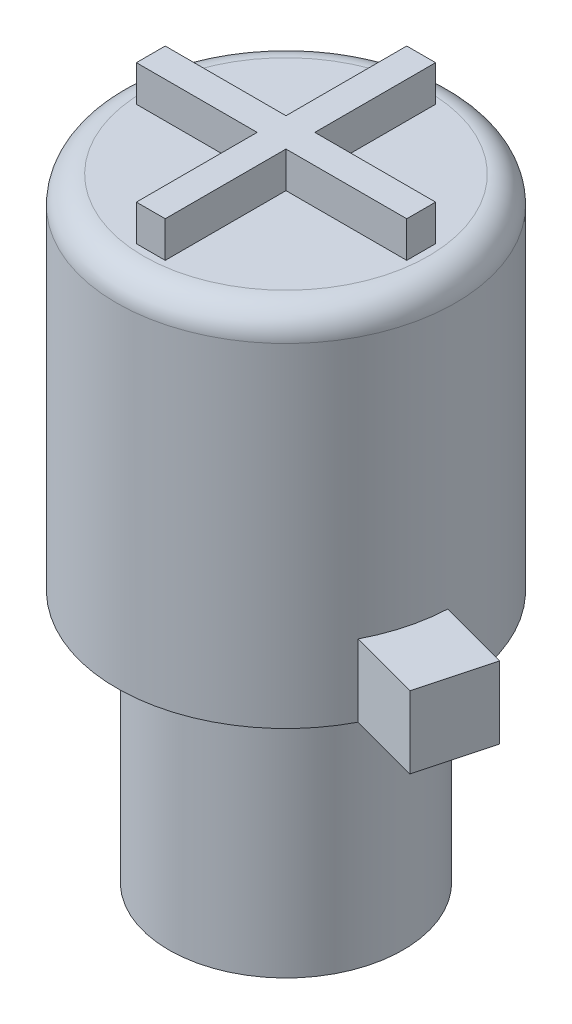
ISO-10303-21;
HEADER;
FILE_DESCRIPTION(('STEP AP214'),'2;1');
FILE_NAME('part.step','',(''),(''),'','','');
FILE_SCHEMA(('AUTOMOTIVE_DESIGN { 1 0 10303 214 1 1 1 1 }'));
ENDSEC;
DATA;
#1=APPLICATION_CONTEXT('core data for automotive mechanical design processes');
#2=APPLICATION_PROTOCOL_DEFINITION('international standard','automotive_design',2000,#1);
#3=PRODUCT_CONTEXT('',#1,'mechanical');
#4=PRODUCT('Part','Part','',(#3));
#5=PRODUCT_RELATED_PRODUCT_CATEGORY('part','',(#4));
#6=PRODUCT_DEFINITION_FORMATION('','',#4);
#7=PRODUCT_DEFINITION_CONTEXT('part definition',#1,'design');
#8=PRODUCT_DEFINITION('design','',#6,#7);
#9=PRODUCT_DEFINITION_SHAPE('','',#8);
#10=(LENGTH_UNIT() NAMED_UNIT(*) SI_UNIT(.MILLI.,.METRE.));
#11=(NAMED_UNIT(*) PLANE_ANGLE_UNIT() SI_UNIT($,.RADIAN.));
#12=(NAMED_UNIT(*) SI_UNIT($,.STERADIAN.) SOLID_ANGLE_UNIT());
#13=UNCERTAINTY_MEASURE_WITH_UNIT(LENGTH_MEASURE(1.E-05),#10,'distance_accuracy_value','');
#14=(GEOMETRIC_REPRESENTATION_CONTEXT(3) GLOBAL_UNCERTAINTY_ASSIGNED_CONTEXT((#13)) GLOBAL_UNIT_ASSIGNED_CONTEXT((#10,
#11,#12)) REPRESENTATION_CONTEXT('',''));
#15=CARTESIAN_POINT('',(0.,0.,0.));
#16=DIRECTION('',(0.,0.,1.));
#17=DIRECTION('',(1.,0.,0.));
#18=AXIS2_PLACEMENT_3D('',#15,#16,#17);
#19=CARTESIAN_POINT('',(0.,7.018,0.));
#20=DIRECTION('',(0.,-1.,0.));
#21=DIRECTION('',(0.,0.,-1.));
#22=AXIS2_PLACEMENT_3D('',#19,#20,#21);
#23=CYLINDRICAL_SURFACE('',#22,3.25);
#24=CARTESIAN_POINT('',(0.,7.018,0.));
#25=DIRECTION('',(0.,1.,0.));
#26=DIRECTION('',(0.,0.,1.));
#27=AXIS2_PLACEMENT_3D('',#24,#25,#26);
#28=CIRCLE('',#27,3.25);
#29=CARTESIAN_POINT('',(0.,7.018,3.25));
#30=VERTEX_POINT('',#29);
#31=EDGE_CURVE('E424',#30,#30,#28,.T.);
#32=ORIENTED_EDGE('',*,*,#31,.F.);
#33=EDGE_LOOP('',(#32));
#34=FACE_BOUND('',#33,.T.);
#35=CARTESIAN_POINT('',(0.,0.,0.));
#36=DIRECTION('',(0.,1.,0.));
#37=DIRECTION('',(0.,0.,1.));
#38=AXIS2_PLACEMENT_3D('',#35,#36,#37);
#39=CIRCLE('',#38,3.25);
#40=CARTESIAN_POINT('',(0.,0.,3.25));
#41=VERTEX_POINT('',#40);
#42=EDGE_CURVE('E428',#41,#41,#39,.T.);
#43=ORIENTED_EDGE('',*,*,#42,.T.);
#44=EDGE_LOOP('',(#43));
#45=FACE_BOUND('',#44,.T.);
#46=ADVANCED_FACE('F63',(#34,#45),#23,.T.);
#47=CARTESIAN_POINT('',(0.,0.,0.));
#48=DIRECTION('',(0.,1.,0.));
#49=DIRECTION('',(0.,0.,1.));
#50=AXIS2_PLACEMENT_3D('',#47,#48,#49);
#51=PLANE('',#50);
#52=ORIENTED_EDGE('',*,*,#42,.F.);
#53=EDGE_LOOP('',(#52));
#54=FACE_BOUND('',#53,.T.);
#55=ADVANCED_FACE('F456',(#54),#51,.F.);
#56=CARTESIAN_POINT('',(0.,17.018,0.));
#57=DIRECTION('',(0.,-1.,0.));
#58=DIRECTION('',(0.,0.,-1.));
#59=AXIS2_PLACEMENT_3D('',#56,#57,#58);
#60=CYLINDRICAL_SURFACE('',#59,4.7);
#61=CARTESIAN_POINT('',(0.,7.018,0.));
#62=DIRECTION('',(0.,1.,0.));
#63=DIRECTION('',(0.,0.,1.));
#64=AXIS2_PLACEMENT_3D('',#61,#62,#63);
#65=CIRCLE('',#64,4.7);
#66=CARTESIAN_POINT('',(-4.6778447544368,7.018,0.455816249587572));
#67=VERTEX_POINT('',#66);
#68=CARTESIAN_POINT('',(4.16954959355992,7.018,2.16906804569251));
#69=VERTEX_POINT('',#68);
#70=EDGE_CURVE('E420',#67,#69,#65,.T.);
#71=ORIENTED_EDGE('',*,*,#70,.T.);
#72=DIRECTION('',(0.,-1.,0.));
#73=VECTOR('',#72,1.);
#74=CARTESIAN_POINT('',(4.16954959355992,9.018,2.16906804569251));
#75=LINE('',#74,#73);
#76=CARTESIAN_POINT('',(4.16954959355992,9.018,2.16906804569251));
#77=VERTEX_POINT('',#76);
#78=EDGE_CURVE('E79',#77,#69,#75,.T.);
#79=ORIENTED_EDGE('',*,*,#78,.F.);
#80=CARTESIAN_POINT('',(0.,9.018,0.));
#81=DIRECTION('',(0.,1.,0.));
#82=DIRECTION('',(0.,0.,-1.));
#83=AXIS2_PLACEMENT_3D('',#80,#81,#82);
#84=CIRCLE('',#83,4.7);
#85=CARTESIAN_POINT('',(4.69546989320823,9.018,0.20630676667312));
#86=VERTEX_POINT('',#85);
#87=EDGE_CURVE('E83',#77,#86,#84,.T.);
#88=ORIENTED_EDGE('',*,*,#87,.T.);
#89=DIRECTION('',(0.,-1.,0.));
#90=VECTOR('',#89,1.);
#91=CARTESIAN_POINT('',(4.69546989320823,9.018,0.20630676667312));
#92=LINE('',#91,#90);
#93=CARTESIAN_POINT('',(4.69546989320823,7.018,0.20630676667312));
#94=VERTEX_POINT('',#93);
#95=EDGE_CURVE('E213',#86,#94,#92,.T.);
#96=ORIENTED_EDGE('',*,*,#95,.T.);
#97=CARTESIAN_POINT('',(-3.8232242675083,7.018,-2.73367082881894));
#98=VERTEX_POINT('',#97);
#99=EDGE_CURVE('E423',#94,#98,#65,.T.);
#100=ORIENTED_EDGE('',*,*,#99,.T.);
#101=DIRECTION('',(0.,-1.,0.));
#102=VECTOR('',#101,1.);
#103=CARTESIAN_POINT('',(-3.8232242675083,9.018,-2.73367082881894));
#104=LINE('',#103,#102);
#105=CARTESIAN_POINT('',(-3.8232242675083,9.018,-2.73367082881894));
#106=VERTEX_POINT('',#105);
#107=EDGE_CURVE('E259',#106,#98,#104,.T.);
#108=ORIENTED_EDGE('',*,*,#107,.F.);
#109=CARTESIAN_POINT('',(0.,9.018,0.));
#110=DIRECTION('',(0.,1.,0.));
#111=DIRECTION('',(0.,0.,-1.));
#112=AXIS2_PLACEMENT_3D('',#109,#110,#111);
#113=CIRCLE('',#112,4.7);
#114=CARTESIAN_POINT('',(-4.6778447544368,9.018,0.455816249587572));
#115=VERTEX_POINT('',#114);
#116=EDGE_CURVE('E268',#106,#115,#113,.T.);
#117=ORIENTED_EDGE('',*,*,#116,.T.);
#118=DIRECTION('',(0.,-1.,0.));
#119=VECTOR('',#118,1.);
#120=CARTESIAN_POINT('',(-4.6778447544368,9.018,0.455816249587572));
#121=LINE('',#120,#119);
#122=EDGE_CURVE('E248',#115,#67,#121,.T.);
#123=ORIENTED_EDGE('',*,*,#122,.T.);
#124=EDGE_LOOP('',(#71,#79,#88,#96,#100,#108,#117,#123));
#125=FACE_BOUND('',#124,.T.);
#126=CARTESIAN_POINT('',(0.,16.268,0.));
#127=DIRECTION('',(0.,1.,0.));
#128=DIRECTION('',(0.,0.,1.));
#129=AXIS2_PLACEMENT_3D('',#126,#127,#128);
#130=CIRCLE('',#129,4.7);
#131=CARTESIAN_POINT('',(0.,16.268,4.7));
#132=VERTEX_POINT('',#131);
#133=EDGE_CURVE('E12',#132,#132,#130,.F.);
#134=ORIENTED_EDGE('',*,*,#133,.T.);
#135=EDGE_LOOP('',(#134));
#136=FACE_BOUND('',#135,.T.);
#137=ADVANCED_FACE('F461',(#125,#136),#60,.T.);
#138=CARTESIAN_POINT('',(0.,17.018,0.));
#139=DIRECTION('',(0.,1.,0.));
#140=DIRECTION('',(0.,0.,1.));
#141=AXIS2_PLACEMENT_3D('',#138,#139,#140);
#142=PLANE('',#141);
#143=CARTESIAN_POINT('',(0.,17.018,0.));
#144=DIRECTION('',(0.,1.,0.));
#145=DIRECTION('',(0.,0.,1.));
#146=AXIS2_PLACEMENT_3D('',#143,#144,#145);
#147=CIRCLE('',#146,3.95);
#148=CARTESIAN_POINT('',(0.,17.018,3.95));
#149=VERTEX_POINT('',#148);
#150=EDGE_CURVE('E72',#149,#149,#147,.T.);
#151=ORIENTED_EDGE('',*,*,#150,.T.);
#152=EDGE_LOOP('',(#151));
#153=FACE_BOUND('',#152,.T.);
#154=DIRECTION('',(0.,0.,-1.));
#155=VECTOR('',#154,1.);
#156=CARTESIAN_POINT('',(0.4,17.018,-0.399999999999999));
#157=LINE('',#156,#155);
#158=CARTESIAN_POINT('',(0.4,17.018,-0.399999999999999));
#159=VERTEX_POINT('',#158);
#160=CARTESIAN_POINT('',(0.4,17.018,-3.75));
#161=VERTEX_POINT('',#160);
#162=EDGE_CURVE('E243',#159,#161,#157,.T.);
#163=ORIENTED_EDGE('',*,*,#162,.F.);
#164=DIRECTION('',(-1.,0.,0.));
#165=VECTOR('',#164,1.);
#166=CARTESIAN_POINT('',(3.75,17.018,-0.399999999999999));
#167=LINE('',#166,#165);
#168=CARTESIAN_POINT('',(3.75,17.018,-0.399999999999999));
#169=VERTEX_POINT('',#168);
#170=EDGE_CURVE('E293',#169,#159,#167,.T.);
#171=ORIENTED_EDGE('',*,*,#170,.F.);
#172=DIRECTION('',(0.,0.,-1.));
#173=VECTOR('',#172,1.);
#174=CARTESIAN_POINT('',(3.75,17.018,0.400000000000001));
#175=LINE('',#174,#173);
#176=CARTESIAN_POINT('',(3.75,17.018,0.400000000000001));
#177=VERTEX_POINT('',#176);
#178=EDGE_CURVE('E366',#177,#169,#175,.T.);
#179=ORIENTED_EDGE('',*,*,#178,.F.);
#180=DIRECTION('',(1.,0.,0.));
#181=VECTOR('',#180,1.);
#182=CARTESIAN_POINT('',(0.4,17.018,0.400000000000001));
#183=LINE('',#182,#181);
#184=CARTESIAN_POINT('',(0.4,17.018,0.400000000000001));
#185=VERTEX_POINT('',#184);
#186=EDGE_CURVE('E362',#185,#177,#183,.T.);
#187=ORIENTED_EDGE('',*,*,#186,.F.);
#188=DIRECTION('',(0.,0.,-1.));
#189=VECTOR('',#188,1.);
#190=CARTESIAN_POINT('',(0.4,17.018,3.75));
#191=LINE('',#190,#189);
#192=CARTESIAN_POINT('',(0.4,17.018,3.75));
#193=VERTEX_POINT('',#192);
#194=EDGE_CURVE('E358',#193,#185,#191,.T.);
#195=ORIENTED_EDGE('',*,*,#194,.F.);
#196=DIRECTION('',(1.,0.,0.));
#197=VECTOR('',#196,1.);
#198=CARTESIAN_POINT('',(-0.4,17.018,3.75));
#199=LINE('',#198,#197);
#200=CARTESIAN_POINT('',(-0.4,17.018,3.75));
#201=VERTEX_POINT('',#200);
#202=EDGE_CURVE('E354',#201,#193,#199,.T.);
#203=ORIENTED_EDGE('',*,*,#202,.F.);
#204=DIRECTION('',(0.,0.,1.));
#205=VECTOR('',#204,1.);
#206=CARTESIAN_POINT('',(-0.4,17.018,0.400000000000001));
#207=LINE('',#206,#205);
#208=CARTESIAN_POINT('',(-0.4,17.018,0.400000000000001));
#209=VERTEX_POINT('',#208);
#210=EDGE_CURVE('E350',#209,#201,#207,.T.);
#211=ORIENTED_EDGE('',*,*,#210,.F.);
#212=DIRECTION('',(1.,0.,0.));
#213=VECTOR('',#212,1.);
#214=CARTESIAN_POINT('',(-3.75,17.018,0.400000000000001));
#215=LINE('',#214,#213);
#216=CARTESIAN_POINT('',(-3.75,17.018,0.400000000000001));
#217=VERTEX_POINT('',#216);
#218=EDGE_CURVE('E346',#217,#209,#215,.T.);
#219=ORIENTED_EDGE('',*,*,#218,.F.);
#220=DIRECTION('',(0.,0.,1.));
#221=VECTOR('',#220,1.);
#222=CARTESIAN_POINT('',(-3.75,17.018,-0.399999999999999));
#223=LINE('',#222,#221);
#224=CARTESIAN_POINT('',(-3.75,17.018,-0.399999999999999));
#225=VERTEX_POINT('',#224);
#226=EDGE_CURVE('E342',#225,#217,#223,.T.);
#227=ORIENTED_EDGE('',*,*,#226,.F.);
#228=DIRECTION('',(-1.,0.,0.));
#229=VECTOR('',#228,1.);
#230=CARTESIAN_POINT('',(-0.4,17.018,-0.399999999999999));
#231=LINE('',#230,#229);
#232=CARTESIAN_POINT('',(-0.4,17.018,-0.399999999999999));
#233=VERTEX_POINT('',#232);
#234=EDGE_CURVE('E338',#233,#225,#231,.T.);
#235=ORIENTED_EDGE('',*,*,#234,.F.);
#236=DIRECTION('',(0.,0.,1.));
#237=VECTOR('',#236,1.);
#238=CARTESIAN_POINT('',(-0.4,17.018,-3.75));
#239=LINE('',#238,#237);
#240=CARTESIAN_POINT('',(-0.4,17.018,-3.75));
#241=VERTEX_POINT('',#240);
#242=EDGE_CURVE('E334',#241,#233,#239,.T.);
#243=ORIENTED_EDGE('',*,*,#242,.F.);
#244=DIRECTION('',(-1.,0.,0.));
#245=VECTOR('',#244,1.);
#246=CARTESIAN_POINT('',(0.4,17.018,-3.75));
#247=LINE('',#246,#245);
#248=EDGE_CURVE('E330',#161,#241,#247,.T.);
#249=ORIENTED_EDGE('',*,*,#248,.F.);
#250=EDGE_LOOP('',(#163,#171,#179,#187,#195,#203,#211,#219,#227,#235,#243,#249));
#251=FACE_BOUND('',#250,.T.);
#252=ADVANCED_FACE('F435',(#153,#251),#142,.T.);
#253=CARTESIAN_POINT('',(0.,7.018,0.));
#254=DIRECTION('',(0.,1.,0.));
#255=DIRECTION('',(0.,0.,1.));
#256=AXIS2_PLACEMENT_3D('',#253,#254,#255);
#257=PLANE('',#256);
#258=ORIENTED_EDGE('',*,*,#31,.T.);
#259=EDGE_LOOP('',(#258));
#260=FACE_BOUND('',#259,.T.);
#261=ORIENTED_EDGE('',*,*,#99,.F.);
#262=DIRECTION('',(0.96592582628907,0.,0.258819045102515));
#263=VECTOR('',#262,1.);
#264=CARTESIAN_POINT('',(6.65823117222762,7.018,0.732227066321429));
#265=LINE('',#264,#263);
#266=CARTESIAN_POINT('',(6.65823117222762,7.018,0.732227066321429));
#267=VERTEX_POINT('',#266);
#268=EDGE_CURVE('E232',#94,#267,#265,.T.);
#269=ORIENTED_EDGE('',*,*,#268,.T.);
#270=DIRECTION('',(-0.258819045102515,0.,0.96592582628907));
#271=VECTOR('',#270,1.);
#272=CARTESIAN_POINT('',(6.13231087257931,7.018,2.69498834534082));
#273=LINE('',#272,#271);
#274=CARTESIAN_POINT('',(6.13231087257931,7.018,2.69498834534082));
#275=VERTEX_POINT('',#274);
#276=EDGE_CURVE('E206',#267,#275,#273,.T.);
#277=ORIENTED_EDGE('',*,*,#276,.T.);
#278=DIRECTION('',(-0.96592582628907,0.,-0.258819045102515));
#279=VECTOR('',#278,1.);
#280=CARTESIAN_POINT('',(4.16954959355992,7.018,2.16906804569251));
#281=LINE('',#280,#279);
#282=EDGE_CURVE('E227',#275,#69,#281,.T.);
#283=ORIENTED_EDGE('',*,*,#282,.T.);
#284=ORIENTED_EDGE('',*,*,#70,.F.);
#285=DIRECTION('',(-0.96592582628907,0.,-0.258819045102515));
#286=VECTOR('',#285,1.);
#287=CARTESIAN_POINT('',(-4.6778447544368,7.018,0.455816249587572));
#288=LINE('',#287,#286);
#289=CARTESIAN_POINT('',(-6.64060603345619,7.018,-0.0701040500607376));
#290=VERTEX_POINT('',#289);
#291=EDGE_CURVE('E235',#67,#290,#288,.T.);
#292=ORIENTED_EDGE('',*,*,#291,.T.);
#293=DIRECTION('',(0.258819045102515,0.,-0.96592582628907));
#294=VECTOR('',#293,1.);
#295=CARTESIAN_POINT('',(-6.64060603345619,7.018,-0.0701040500607376));
#296=LINE('',#295,#294);
#297=CARTESIAN_POINT('',(-5.78598554652769,7.018,-3.25959112846725));
#298=VERTEX_POINT('',#297);
#299=EDGE_CURVE('E267',#290,#298,#296,.T.);
#300=ORIENTED_EDGE('',*,*,#299,.T.);
#301=DIRECTION('',(0.96592582628907,0.,0.258819045102515));
#302=VECTOR('',#301,1.);
#303=CARTESIAN_POINT('',(-5.78598554652769,7.018,-3.25959112846725));
#304=LINE('',#303,#302);
#305=EDGE_CURVE('E263',#298,#98,#304,.T.);
#306=ORIENTED_EDGE('',*,*,#305,.T.);
#307=EDGE_LOOP('',(#261,#269,#277,#283,#284,#292,#300,#306));
#308=FACE_BOUND('',#307,.T.);
#309=ADVANCED_FACE('F468',(#260,#308),#257,.F.);
#310=CARTESIAN_POINT('',(0.4,18.018,-0.399999999999999));
#311=DIRECTION('',(-1.,0.,0.));
#312=DIRECTION('',(0.,0.,1.));
#313=AXIS2_PLACEMENT_3D('',#310,#311,#312);
#314=PLANE('',#313);
#315=ORIENTED_EDGE('',*,*,#162,.T.);
#316=DIRECTION('',(0.,-1.,0.));
#317=VECTOR('',#316,1.);
#318=CARTESIAN_POINT('',(0.4,18.018,-3.75));
#319=LINE('',#318,#317);
#320=CARTESIAN_POINT('',(0.4,18.018,-3.75));
#321=VERTEX_POINT('',#320);
#322=EDGE_CURVE('E416',#321,#161,#319,.T.);
#323=ORIENTED_EDGE('',*,*,#322,.F.);
#324=DIRECTION('',(0.,0.,-1.));
#325=VECTOR('',#324,1.);
#326=CARTESIAN_POINT('',(0.4,18.018,-0.399999999999999));
#327=LINE('',#326,#325);
#328=CARTESIAN_POINT('',(0.4,18.018,-0.399999999999999));
#329=VERTEX_POINT('',#328);
#330=EDGE_CURVE('E288',#329,#321,#327,.T.);
#331=ORIENTED_EDGE('',*,*,#330,.F.);
#332=DIRECTION('',(0.,-1.,0.));
#333=VECTOR('',#332,1.);
#334=CARTESIAN_POINT('',(0.4,18.018,-0.399999999999999));
#335=LINE('',#334,#333);
#336=EDGE_CURVE('E326',#329,#159,#335,.T.);
#337=ORIENTED_EDGE('',*,*,#336,.T.);
#338=EDGE_LOOP('',(#315,#323,#331,#337));
#339=FACE_BOUND('',#338,.T.);
#340=ADVANCED_FACE('F471',(#339),#314,.F.);
#341=CARTESIAN_POINT('',(0.4,18.018,-3.75));
#342=DIRECTION('',(0.,0.,1.));
#343=DIRECTION('',(1.,0.,0.));
#344=AXIS2_PLACEMENT_3D('',#341,#342,#343);
#345=PLANE('',#344);
#346=ORIENTED_EDGE('',*,*,#248,.T.);
#347=DIRECTION('',(0.,-1.,0.));
#348=VECTOR('',#347,1.);
#349=CARTESIAN_POINT('',(-0.4,18.018,-3.75));
#350=LINE('',#349,#348);
#351=CARTESIAN_POINT('',(-0.4,18.018,-3.75));
#352=VERTEX_POINT('',#351);
#353=EDGE_CURVE('E412',#352,#241,#350,.T.);
#354=ORIENTED_EDGE('',*,*,#353,.F.);
#355=DIRECTION('',(-1.,0.,0.));
#356=VECTOR('',#355,1.);
#357=CARTESIAN_POINT('',(0.4,18.018,-3.75));
#358=LINE('',#357,#356);
#359=EDGE_CURVE('E292',#321,#352,#358,.T.);
#360=ORIENTED_EDGE('',*,*,#359,.F.);
#361=ORIENTED_EDGE('',*,*,#322,.T.);
#362=EDGE_LOOP('',(#346,#354,#360,#361));
#363=FACE_BOUND('',#362,.T.);
#364=ADVANCED_FACE('F476',(#363),#345,.F.);
#365=CARTESIAN_POINT('',(-0.4,18.018,-3.75));
#366=DIRECTION('',(1.,0.,0.));
#367=DIRECTION('',(0.,0.,-1.));
#368=AXIS2_PLACEMENT_3D('',#365,#366,#367);
#369=PLANE('',#368);
#370=ORIENTED_EDGE('',*,*,#242,.T.);
#371=DIRECTION('',(0.,-1.,0.));
#372=VECTOR('',#371,1.);
#373=CARTESIAN_POINT('',(-0.4,18.018,-0.399999999999999));
#374=LINE('',#373,#372);
#375=CARTESIAN_POINT('',(-0.4,18.018,-0.399999999999999));
#376=VERTEX_POINT('',#375);
#377=EDGE_CURVE('E408',#376,#233,#374,.T.);
#378=ORIENTED_EDGE('',*,*,#377,.F.);
#379=DIRECTION('',(0.,0.,1.));
#380=VECTOR('',#379,1.);
#381=CARTESIAN_POINT('',(-0.4,18.018,-3.75));
#382=LINE('',#381,#380);
#383=EDGE_CURVE('E296',#352,#376,#382,.T.);
#384=ORIENTED_EDGE('',*,*,#383,.F.);
#385=ORIENTED_EDGE('',*,*,#353,.T.);
#386=EDGE_LOOP('',(#370,#378,#384,#385));
#387=FACE_BOUND('',#386,.T.);
#388=ADVANCED_FACE('F480',(#387),#369,.F.);
#389=CARTESIAN_POINT('',(-0.4,18.018,-0.399999999999999));
#390=DIRECTION('',(0.,0.,1.));
#391=DIRECTION('',(1.,0.,0.));
#392=AXIS2_PLACEMENT_3D('',#389,#390,#391);
#393=PLANE('',#392);
#394=ORIENTED_EDGE('',*,*,#234,.T.);
#395=DIRECTION('',(0.,-1.,0.));
#396=VECTOR('',#395,1.);
#397=CARTESIAN_POINT('',(-3.75,18.018,-0.399999999999999));
#398=LINE('',#397,#396);
#399=CARTESIAN_POINT('',(-3.75,18.018,-0.399999999999999));
#400=VERTEX_POINT('',#399);
#401=EDGE_CURVE('E404',#400,#225,#398,.T.);
#402=ORIENTED_EDGE('',*,*,#401,.F.);
#403=DIRECTION('',(-1.,0.,0.));
#404=VECTOR('',#403,1.);
#405=CARTESIAN_POINT('',(-0.4,18.018,-0.399999999999999));
#406=LINE('',#405,#404);
#407=EDGE_CURVE('E299',#376,#400,#406,.T.);
#408=ORIENTED_EDGE('',*,*,#407,.F.);
#409=ORIENTED_EDGE('',*,*,#377,.T.);
#410=EDGE_LOOP('',(#394,#402,#408,#409));
#411=FACE_BOUND('',#410,.T.);
#412=ADVANCED_FACE('F484',(#411),#393,.F.);
#413=CARTESIAN_POINT('',(-3.75,18.018,-0.399999999999999));
#414=DIRECTION('',(1.,0.,0.));
#415=DIRECTION('',(0.,0.,-1.));
#416=AXIS2_PLACEMENT_3D('',#413,#414,#415);
#417=PLANE('',#416);
#418=ORIENTED_EDGE('',*,*,#226,.T.);
#419=DIRECTION('',(0.,-1.,0.));
#420=VECTOR('',#419,1.);
#421=CARTESIAN_POINT('',(-3.75,18.018,0.400000000000001));
#422=LINE('',#421,#420);
#423=CARTESIAN_POINT('',(-3.75,18.018,0.400000000000001));
#424=VERTEX_POINT('',#423);
#425=EDGE_CURVE('E400',#424,#217,#422,.T.);
#426=ORIENTED_EDGE('',*,*,#425,.F.);
#427=DIRECTION('',(0.,0.,1.));
#428=VECTOR('',#427,1.);
#429=CARTESIAN_POINT('',(-3.75,18.018,-0.399999999999999));
#430=LINE('',#429,#428);
#431=EDGE_CURVE('E302',#400,#424,#430,.T.);
#432=ORIENTED_EDGE('',*,*,#431,.F.);
#433=ORIENTED_EDGE('',*,*,#401,.T.);
#434=EDGE_LOOP('',(#418,#426,#432,#433));
#435=FACE_BOUND('',#434,.T.);
#436=ADVANCED_FACE('F488',(#435),#417,.F.);
#437=CARTESIAN_POINT('',(-3.75,18.018,0.400000000000001));
#438=DIRECTION('',(0.,0.,-1.));
#439=DIRECTION('',(-1.,0.,0.));
#440=AXIS2_PLACEMENT_3D('',#437,#438,#439);
#441=PLANE('',#440);
#442=ORIENTED_EDGE('',*,*,#218,.T.);
#443=DIRECTION('',(0.,-1.,0.));
#444=VECTOR('',#443,1.);
#445=CARTESIAN_POINT('',(-0.4,18.018,0.400000000000001));
#446=LINE('',#445,#444);
#447=CARTESIAN_POINT('',(-0.4,18.018,0.400000000000001));
#448=VERTEX_POINT('',#447);
#449=EDGE_CURVE('E396',#448,#209,#446,.T.);
#450=ORIENTED_EDGE('',*,*,#449,.F.);
#451=DIRECTION('',(1.,0.,0.));
#452=VECTOR('',#451,1.);
#453=CARTESIAN_POINT('',(-3.75,18.018,0.400000000000001));
#454=LINE('',#453,#452);
#455=EDGE_CURVE('E305',#424,#448,#454,.T.);
#456=ORIENTED_EDGE('',*,*,#455,.F.);
#457=ORIENTED_EDGE('',*,*,#425,.T.);
#458=EDGE_LOOP('',(#442,#450,#456,#457));
#459=FACE_BOUND('',#458,.T.);
#460=ADVANCED_FACE('F492',(#459),#441,.F.);
#461=CARTESIAN_POINT('',(-0.4,18.018,0.400000000000001));
#462=DIRECTION('',(1.,0.,0.));
#463=DIRECTION('',(0.,0.,-1.));
#464=AXIS2_PLACEMENT_3D('',#461,#462,#463);
#465=PLANE('',#464);
#466=ORIENTED_EDGE('',*,*,#210,.T.);
#467=DIRECTION('',(0.,-1.,0.));
#468=VECTOR('',#467,1.);
#469=CARTESIAN_POINT('',(-0.4,18.018,3.75));
#470=LINE('',#469,#468);
#471=CARTESIAN_POINT('',(-0.4,18.018,3.75));
#472=VERTEX_POINT('',#471);
#473=EDGE_CURVE('E392',#472,#201,#470,.T.);
#474=ORIENTED_EDGE('',*,*,#473,.F.);
#475=DIRECTION('',(0.,0.,1.));
#476=VECTOR('',#475,1.);
#477=CARTESIAN_POINT('',(-0.4,18.018,0.400000000000001));
#478=LINE('',#477,#476);
#479=EDGE_CURVE('E308',#448,#472,#478,.T.);
#480=ORIENTED_EDGE('',*,*,#479,.F.);
#481=ORIENTED_EDGE('',*,*,#449,.T.);
#482=EDGE_LOOP('',(#466,#474,#480,#481));
#483=FACE_BOUND('',#482,.T.);
#484=ADVANCED_FACE('F496',(#483),#465,.F.);
#485=CARTESIAN_POINT('',(-0.4,18.018,3.75));
#486=DIRECTION('',(0.,0.,-1.));
#487=DIRECTION('',(-1.,0.,0.));
#488=AXIS2_PLACEMENT_3D('',#485,#486,#487);
#489=PLANE('',#488);
#490=ORIENTED_EDGE('',*,*,#202,.T.);
#491=DIRECTION('',(0.,-1.,0.));
#492=VECTOR('',#491,1.);
#493=CARTESIAN_POINT('',(0.4,18.018,3.75));
#494=LINE('',#493,#492);
#495=CARTESIAN_POINT('',(0.4,18.018,3.75));
#496=VERTEX_POINT('',#495);
#497=EDGE_CURVE('E388',#496,#193,#494,.T.);
#498=ORIENTED_EDGE('',*,*,#497,.F.);
#499=DIRECTION('',(1.,0.,0.));
#500=VECTOR('',#499,1.);
#501=CARTESIAN_POINT('',(-0.4,18.018,3.75));
#502=LINE('',#501,#500);
#503=EDGE_CURVE('E311',#472,#496,#502,.T.);
#504=ORIENTED_EDGE('',*,*,#503,.F.);
#505=ORIENTED_EDGE('',*,*,#473,.T.);
#506=EDGE_LOOP('',(#490,#498,#504,#505));
#507=FACE_BOUND('',#506,.T.);
#508=ADVANCED_FACE('F500',(#507),#489,.F.);
#509=CARTESIAN_POINT('',(0.4,18.018,3.75));
#510=DIRECTION('',(-1.,0.,0.));
#511=DIRECTION('',(0.,0.,1.));
#512=AXIS2_PLACEMENT_3D('',#509,#510,#511);
#513=PLANE('',#512);
#514=ORIENTED_EDGE('',*,*,#194,.T.);
#515=DIRECTION('',(0.,-1.,0.));
#516=VECTOR('',#515,1.);
#517=CARTESIAN_POINT('',(0.4,18.018,0.400000000000001));
#518=LINE('',#517,#516);
#519=CARTESIAN_POINT('',(0.4,18.018,0.400000000000001));
#520=VERTEX_POINT('',#519);
#521=EDGE_CURVE('E384',#520,#185,#518,.T.);
#522=ORIENTED_EDGE('',*,*,#521,.F.);
#523=DIRECTION('',(0.,0.,-1.));
#524=VECTOR('',#523,1.);
#525=CARTESIAN_POINT('',(0.4,18.018,3.75));
#526=LINE('',#525,#524);
#527=EDGE_CURVE('E314',#496,#520,#526,.T.);
#528=ORIENTED_EDGE('',*,*,#527,.F.);
#529=ORIENTED_EDGE('',*,*,#497,.T.);
#530=EDGE_LOOP('',(#514,#522,#528,#529));
#531=FACE_BOUND('',#530,.T.);
#532=ADVANCED_FACE('F504',(#531),#513,.F.);
#533=CARTESIAN_POINT('',(0.4,18.018,0.400000000000001));
#534=DIRECTION('',(0.,0.,-1.));
#535=DIRECTION('',(-1.,0.,0.));
#536=AXIS2_PLACEMENT_3D('',#533,#534,#535);
#537=PLANE('',#536);
#538=ORIENTED_EDGE('',*,*,#186,.T.);
#539=DIRECTION('',(0.,-1.,0.));
#540=VECTOR('',#539,1.);
#541=CARTESIAN_POINT('',(3.75,18.018,0.400000000000001));
#542=LINE('',#541,#540);
#543=CARTESIAN_POINT('',(3.75,18.018,0.400000000000001));
#544=VERTEX_POINT('',#543);
#545=EDGE_CURVE('E380',#544,#177,#542,.T.);
#546=ORIENTED_EDGE('',*,*,#545,.F.);
#547=DIRECTION('',(1.,0.,0.));
#548=VECTOR('',#547,1.);
#549=CARTESIAN_POINT('',(0.4,18.018,0.400000000000001));
#550=LINE('',#549,#548);
#551=EDGE_CURVE('E317',#520,#544,#550,.T.);
#552=ORIENTED_EDGE('',*,*,#551,.F.);
#553=ORIENTED_EDGE('',*,*,#521,.T.);
#554=EDGE_LOOP('',(#538,#546,#552,#553));
#555=FACE_BOUND('',#554,.T.);
#556=ADVANCED_FACE('F508',(#555),#537,.F.);
#557=CARTESIAN_POINT('',(3.75,18.018,0.400000000000001));
#558=DIRECTION('',(-1.,0.,0.));
#559=DIRECTION('',(0.,0.,1.));
#560=AXIS2_PLACEMENT_3D('',#557,#558,#559);
#561=PLANE('',#560);
#562=ORIENTED_EDGE('',*,*,#178,.T.);
#563=DIRECTION('',(0.,-1.,0.));
#564=VECTOR('',#563,1.);
#565=CARTESIAN_POINT('',(3.75,18.018,-0.399999999999999));
#566=LINE('',#565,#564);
#567=CARTESIAN_POINT('',(3.75,18.018,-0.399999999999999));
#568=VERTEX_POINT('',#567);
#569=EDGE_CURVE('E376',#568,#169,#566,.T.);
#570=ORIENTED_EDGE('',*,*,#569,.F.);
#571=DIRECTION('',(0.,0.,-1.));
#572=VECTOR('',#571,1.);
#573=CARTESIAN_POINT('',(3.75,18.018,0.400000000000001));
#574=LINE('',#573,#572);
#575=EDGE_CURVE('E320',#544,#568,#574,.T.);
#576=ORIENTED_EDGE('',*,*,#575,.F.);
#577=ORIENTED_EDGE('',*,*,#545,.T.);
#578=EDGE_LOOP('',(#562,#570,#576,#577));
#579=FACE_BOUND('',#578,.T.);
#580=ADVANCED_FACE('F512',(#579),#561,.F.);
#581=CARTESIAN_POINT('',(3.75,18.018,-0.399999999999999));
#582=DIRECTION('',(0.,0.,1.));
#583=DIRECTION('',(1.,0.,0.));
#584=AXIS2_PLACEMENT_3D('',#581,#582,#583);
#585=PLANE('',#584);
#586=ORIENTED_EDGE('',*,*,#170,.T.);
#587=ORIENTED_EDGE('',*,*,#336,.F.);
#588=DIRECTION('',(-1.,0.,0.));
#589=VECTOR('',#588,1.);
#590=CARTESIAN_POINT('',(3.75,18.018,-0.399999999999999));
#591=LINE('',#590,#589);
#592=EDGE_CURVE('E323',#568,#329,#591,.T.);
#593=ORIENTED_EDGE('',*,*,#592,.F.);
#594=ORIENTED_EDGE('',*,*,#569,.T.);
#595=EDGE_LOOP('',(#586,#587,#593,#594));
#596=FACE_BOUND('',#595,.T.);
#597=ADVANCED_FACE('F451',(#596),#585,.F.);
#598=CARTESIAN_POINT('',(0.,18.018,0.));
#599=DIRECTION('',(0.,1.,0.));
#600=DIRECTION('',(0.,0.,1.));
#601=AXIS2_PLACEMENT_3D('',#598,#599,#600);
#602=PLANE('',#601);
#603=ORIENTED_EDGE('',*,*,#330,.T.);
#604=ORIENTED_EDGE('',*,*,#359,.T.);
#605=ORIENTED_EDGE('',*,*,#383,.T.);
#606=ORIENTED_EDGE('',*,*,#407,.T.);
#607=ORIENTED_EDGE('',*,*,#431,.T.);
#608=ORIENTED_EDGE('',*,*,#455,.T.);
#609=ORIENTED_EDGE('',*,*,#479,.T.);
#610=ORIENTED_EDGE('',*,*,#503,.T.);
#611=ORIENTED_EDGE('',*,*,#527,.T.);
#612=ORIENTED_EDGE('',*,*,#551,.T.);
#613=ORIENTED_EDGE('',*,*,#575,.T.);
#614=ORIENTED_EDGE('',*,*,#592,.T.);
#615=EDGE_LOOP('',(#603,#604,#605,#606,#607,#608,#609,#610,#611,#612,#613,#614));
#616=FACE_BOUND('',#615,.T.);
#617=ADVANCED_FACE('F440',(#616),#602,.T.);
#618=CARTESIAN_POINT('',(0.,16.268,0.));
#619=DIRECTION('',(0.,1.,0.));
#620=DIRECTION('',(0.,0.,1.));
#621=AXIS2_PLACEMENT_3D('',#618,#619,#620);
#622=TOROIDAL_SURFACE('',#621,3.95,0.75);
#623=ORIENTED_EDGE('',*,*,#133,.F.);
#624=EDGE_LOOP('',(#623));
#625=FACE_BOUND('',#624,.T.);
#626=ORIENTED_EDGE('',*,*,#150,.F.);
#627=EDGE_LOOP('',(#626));
#628=FACE_BOUND('',#627,.T.);
#629=ADVANCED_FACE('F65',(#625,#628),#622,.T.);
#630=CARTESIAN_POINT('',(-5.78598554652769,9.018,-3.25959112846725));
#631=DIRECTION('',(0.258819045102515,0.,-0.96592582628907));
#632=DIRECTION('',(-0.96592582628907,0.,-0.258819045102515));
#633=AXIS2_PLACEMENT_3D('',#630,#631,#632);
#634=PLANE('',#633);
#635=ORIENTED_EDGE('',*,*,#305,.F.);
#636=DIRECTION('',(0.,-1.,0.));
#637=VECTOR('',#636,1.);
#638=CARTESIAN_POINT('',(-5.78598554652769,9.018,-3.25959112846725));
#639=LINE('',#638,#637);
#640=CARTESIAN_POINT('',(-5.78598554652769,9.018,-3.25959112846725));
#641=VERTEX_POINT('',#640);
#642=EDGE_CURVE('E256',#641,#298,#639,.T.);
#643=ORIENTED_EDGE('',*,*,#642,.F.);
#644=DIRECTION('',(0.96592582628907,0.,0.258819045102515));
#645=VECTOR('',#644,1.);
#646=CARTESIAN_POINT('',(-5.78598554652769,9.018,-3.25959112846725));
#647=LINE('',#646,#645);
#648=EDGE_CURVE('E252',#641,#106,#647,.T.);
#649=ORIENTED_EDGE('',*,*,#648,.T.);
#650=ORIENTED_EDGE('',*,*,#107,.T.);
#651=EDGE_LOOP('',(#635,#643,#649,#650));
#652=FACE_BOUND('',#651,.T.);
#653=ADVANCED_FACE('F439',(#652),#634,.T.);
#654=CARTESIAN_POINT('',(-6.64060603345619,9.018,-0.0701040500607376));
#655=DIRECTION('',(-0.96592582628907,0.,-0.258819045102515));
#656=DIRECTION('',(-0.258819045102515,0.,0.96592582628907));
#657=AXIS2_PLACEMENT_3D('',#654,#655,#656);
#658=PLANE('',#657);
#659=ORIENTED_EDGE('',*,*,#299,.F.);
#660=DIRECTION('',(0.,-1.,0.));
#661=VECTOR('',#660,1.);
#662=CARTESIAN_POINT('',(-6.64060603345619,9.018,-0.0701040500607376));
#663=LINE('',#662,#661);
#664=CARTESIAN_POINT('',(-6.64060603345619,9.018,-0.0701040500607376));
#665=VERTEX_POINT('',#664);
#666=EDGE_CURVE('E253',#665,#290,#663,.T.);
#667=ORIENTED_EDGE('',*,*,#666,.F.);
#668=DIRECTION('',(0.258819045102515,0.,-0.96592582628907));
#669=VECTOR('',#668,1.);
#670=CARTESIAN_POINT('',(-6.64060603345619,9.018,-0.0701040500607376));
#671=LINE('',#670,#669);
#672=EDGE_CURVE('E278',#665,#641,#671,.T.);
#673=ORIENTED_EDGE('',*,*,#672,.T.);
#674=ORIENTED_EDGE('',*,*,#642,.T.);
#675=EDGE_LOOP('',(#659,#667,#673,#674));
#676=FACE_BOUND('',#675,.T.);
#677=ADVANCED_FACE('F447',(#676),#658,.T.);
#678=CARTESIAN_POINT('',(-4.6778447544368,9.018,0.455816249587572));
#679=DIRECTION('',(-0.258819045102515,0.,0.96592582628907));
#680=DIRECTION('',(0.96592582628907,0.,0.258819045102515));
#681=AXIS2_PLACEMENT_3D('',#678,#679,#680);
#682=PLANE('',#681);
#683=ORIENTED_EDGE('',*,*,#291,.F.);
#684=ORIENTED_EDGE('',*,*,#122,.F.);
#685=DIRECTION('',(-0.96592582628907,0.,-0.258819045102515));
#686=VECTOR('',#685,1.);
#687=CARTESIAN_POINT('',(-4.6778447544368,9.018,0.455816249587572));
#688=LINE('',#687,#686);
#689=EDGE_CURVE('E282',#115,#665,#688,.T.);
#690=ORIENTED_EDGE('',*,*,#689,.T.);
#691=ORIENTED_EDGE('',*,*,#666,.T.);
#692=EDGE_LOOP('',(#683,#684,#690,#691));
#693=FACE_BOUND('',#692,.T.);
#694=ADVANCED_FACE('F523',(#693),#682,.T.);
#695=CARTESIAN_POINT('',(0.,9.018,0.));
#696=DIRECTION('',(0.,-1.,0.));
#697=DIRECTION('',(0.,0.,-1.));
#698=AXIS2_PLACEMENT_3D('',#695,#696,#697);
#699=PLANE('',#698);
#700=ORIENTED_EDGE('',*,*,#116,.F.);
#701=ORIENTED_EDGE('',*,*,#648,.F.);
#702=ORIENTED_EDGE('',*,*,#672,.F.);
#703=ORIENTED_EDGE('',*,*,#689,.F.);
#704=EDGE_LOOP('',(#700,#701,#702,#703));
#705=FACE_BOUND('',#704,.T.);
#706=ADVANCED_FACE('F520',(#705),#699,.F.);
#707=CARTESIAN_POINT('',(4.16954959355992,9.018,2.16906804569251));
#708=DIRECTION('',(-0.258819045102515,0.,0.96592582628907));
#709=DIRECTION('',(0.96592582628907,0.,0.258819045102515));
#710=AXIS2_PLACEMENT_3D('',#707,#708,#709);
#711=PLANE('',#710);
#712=ORIENTED_EDGE('',*,*,#282,.F.);
#713=DIRECTION('',(0.,-1.,0.));
#714=VECTOR('',#713,1.);
#715=CARTESIAN_POINT('',(6.13231087257931,9.018,2.69498834534082));
#716=LINE('',#715,#714);
#717=CARTESIAN_POINT('',(6.13231087257931,9.018,2.69498834534082));
#718=VERTEX_POINT('',#717);
#719=EDGE_CURVE('E212',#718,#275,#716,.T.);
#720=ORIENTED_EDGE('',*,*,#719,.F.);
#721=DIRECTION('',(-0.96592582628907,0.,-0.258819045102515));
#722=VECTOR('',#721,1.);
#723=CARTESIAN_POINT('',(4.16954959355992,9.018,2.16906804569251));
#724=LINE('',#723,#722);
#725=EDGE_CURVE('E220',#718,#77,#724,.T.);
#726=ORIENTED_EDGE('',*,*,#725,.T.);
#727=ORIENTED_EDGE('',*,*,#78,.T.);
#728=EDGE_LOOP('',(#712,#720,#726,#727));
#729=FACE_BOUND('',#728,.T.);
#730=ADVANCED_FACE('F522',(#729),#711,.T.);
#731=CARTESIAN_POINT('',(6.13231087257931,9.018,2.69498834534082));
#732=DIRECTION('',(0.96592582628907,0.,0.258819045102515));
#733=DIRECTION('',(0.258819045102515,0.,-0.96592582628907));
#734=AXIS2_PLACEMENT_3D('',#731,#732,#733);
#735=PLANE('',#734);
#736=ORIENTED_EDGE('',*,*,#276,.F.);
#737=DIRECTION('',(0.,-1.,0.));
#738=VECTOR('',#737,1.);
#739=CARTESIAN_POINT('',(6.65823117222762,9.018,0.732227066321429));
#740=LINE('',#739,#738);
#741=CARTESIAN_POINT('',(6.65823117222762,9.018,0.732227066321429));
#742=VERTEX_POINT('',#741);
#743=EDGE_CURVE('E200',#742,#267,#740,.T.);
#744=ORIENTED_EDGE('',*,*,#743,.F.);
#745=DIRECTION('',(-0.258819045102515,0.,0.96592582628907));
#746=VECTOR('',#745,1.);
#747=CARTESIAN_POINT('',(6.13231087257931,9.018,2.69498834534082));
#748=LINE('',#747,#746);
#749=EDGE_CURVE('E203',#742,#718,#748,.T.);
#750=ORIENTED_EDGE('',*,*,#749,.T.);
#751=ORIENTED_EDGE('',*,*,#719,.T.);
#752=EDGE_LOOP('',(#736,#744,#750,#751));
#753=FACE_BOUND('',#752,.T.);
#754=ADVANCED_FACE('F202',(#753),#735,.T.);
#755=CARTESIAN_POINT('',(6.65823117222762,9.018,0.732227066321429));
#756=DIRECTION('',(0.258819045102515,0.,-0.96592582628907));
#757=DIRECTION('',(-0.96592582628907,0.,-0.258819045102515));
#758=AXIS2_PLACEMENT_3D('',#755,#756,#757);
#759=PLANE('',#758);
#760=ORIENTED_EDGE('',*,*,#268,.F.);
#761=ORIENTED_EDGE('',*,*,#95,.F.);
#762=DIRECTION('',(0.96592582628907,0.,0.258819045102515));
#763=VECTOR('',#762,1.);
#764=CARTESIAN_POINT('',(6.65823117222762,9.018,0.732227066321429));
#765=LINE('',#764,#763);
#766=EDGE_CURVE('E218',#86,#742,#765,.T.);
#767=ORIENTED_EDGE('',*,*,#766,.T.);
#768=ORIENTED_EDGE('',*,*,#743,.T.);
#769=EDGE_LOOP('',(#760,#761,#767,#768));
#770=FACE_BOUND('',#769,.T.);
#771=ADVANCED_FACE('F223',(#770),#759,.T.);
#772=CARTESIAN_POINT('',(0.,9.018,0.));
#773=DIRECTION('',(0.,-1.,0.));
#774=DIRECTION('',(0.,0.,-1.));
#775=AXIS2_PLACEMENT_3D('',#772,#773,#774);
#776=PLANE('',#775);
#777=ORIENTED_EDGE('',*,*,#87,.F.);
#778=ORIENTED_EDGE('',*,*,#725,.F.);
#779=ORIENTED_EDGE('',*,*,#749,.F.);
#780=ORIENTED_EDGE('',*,*,#766,.F.);
#781=EDGE_LOOP('',(#777,#778,#779,#780));
#782=FACE_BOUND('',#781,.T.);
#783=ADVANCED_FACE('F217',(#782),#776,.F.);
#784=CLOSED_SHELL('',(#46,#55,#137,#252,#309,#340,#364,#388,#412,#436,#460,#484,#508,#532,#556,
#580,#597,#617,#629,#653,#677,#694,#706,#730,#754,#771,#783));
#785=MANIFOLD_SOLID_BREP('B2',#784);
#786=ADVANCED_BREP_SHAPE_REPRESENTATION('',(#18,#785),#14);
#787=SHAPE_DEFINITION_REPRESENTATION(#9,#786);
ENDSEC;
END-ISO-10303-21;
